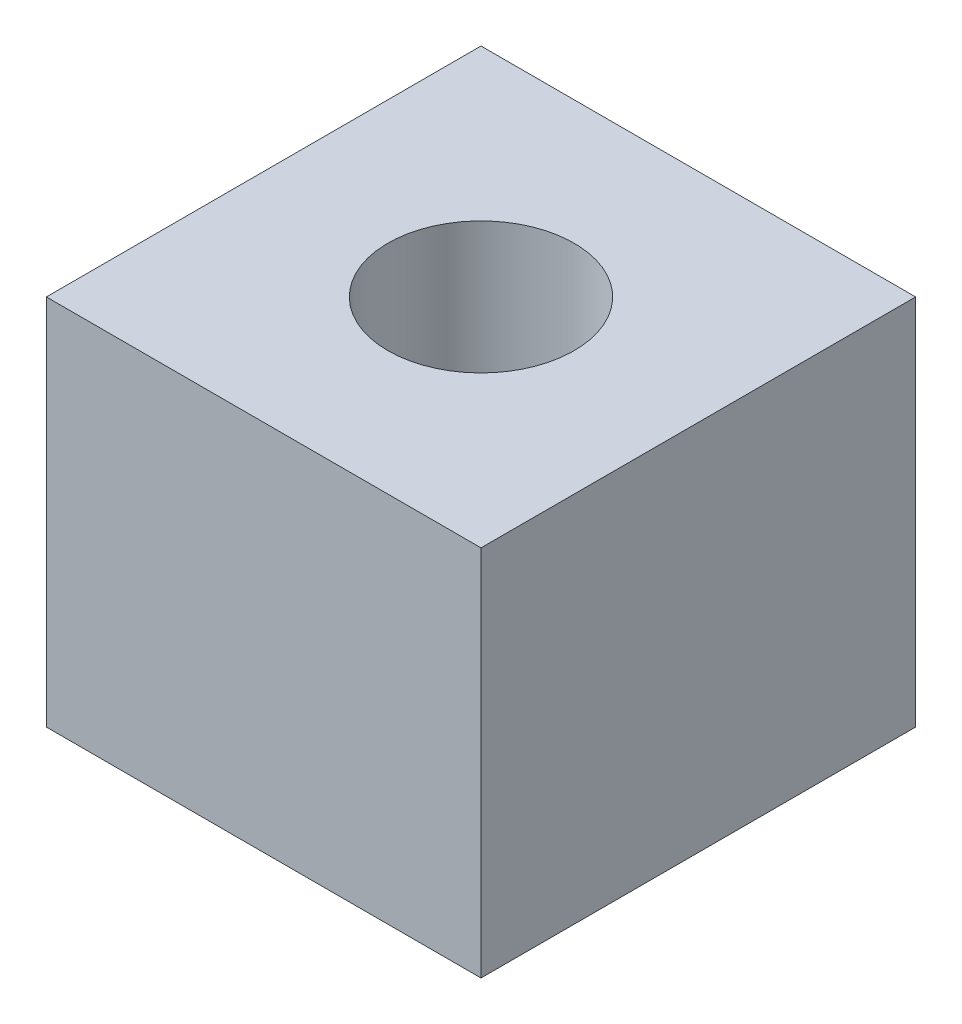
ISO-10303-21;
HEADER;
FILE_DESCRIPTION(('STEP AP214'),'2;1');
FILE_NAME('part.step','',(''),(''),'','','');
FILE_SCHEMA(('AUTOMOTIVE_DESIGN { 1 0 10303 214 1 1 1 1 }'));
ENDSEC;
DATA;
#1=APPLICATION_CONTEXT('core data for automotive mechanical design processes');
#2=APPLICATION_PROTOCOL_DEFINITION('international standard','automotive_design',2000,#1);
#3=PRODUCT_CONTEXT('',#1,'mechanical');
#4=PRODUCT('Part','Part','',(#3));
#5=PRODUCT_RELATED_PRODUCT_CATEGORY('part','',(#4));
#6=PRODUCT_DEFINITION_FORMATION('','',#4);
#7=PRODUCT_DEFINITION_CONTEXT('part definition',#1,'design');
#8=PRODUCT_DEFINITION('design','',#6,#7);
#9=PRODUCT_DEFINITION_SHAPE('','',#8);
#10=(LENGTH_UNIT() NAMED_UNIT(*) SI_UNIT(.MILLI.,.METRE.));
#11=(NAMED_UNIT(*) PLANE_ANGLE_UNIT() SI_UNIT($,.RADIAN.));
#12=(NAMED_UNIT(*) SI_UNIT($,.STERADIAN.) SOLID_ANGLE_UNIT());
#13=UNCERTAINTY_MEASURE_WITH_UNIT(LENGTH_MEASURE(1.E-05),#10,'distance_accuracy_value','');
#14=(GEOMETRIC_REPRESENTATION_CONTEXT(3) GLOBAL_UNCERTAINTY_ASSIGNED_CONTEXT((#13)) GLOBAL_UNIT_ASSIGNED_CONTEXT((#10,
#11,#12)) REPRESENTATION_CONTEXT('',''));
#15=CARTESIAN_POINT('',(0.,0.,0.));
#16=DIRECTION('',(0.,0.,1.));
#17=DIRECTION('',(1.,0.,0.));
#18=AXIS2_PLACEMENT_3D('',#15,#16,#17);
#19=CARTESIAN_POINT('',(17.5,30.,-17.5));
#20=DIRECTION('',(-1.,0.,0.));
#21=DIRECTION('',(0.,0.,1.));
#22=AXIS2_PLACEMENT_3D('',#19,#20,#21);
#23=PLANE('',#22);
#24=DIRECTION('',(0.,0.,-1.));
#25=VECTOR('',#24,1.);
#26=CARTESIAN_POINT('',(17.5,0.,-17.5));
#27=LINE('',#26,#25);
#28=CARTESIAN_POINT('',(17.5,0.,17.5));
#29=VERTEX_POINT('',#28);
#30=CARTESIAN_POINT('',(17.5,0.,-17.5));
#31=VERTEX_POINT('',#30);
#32=EDGE_CURVE('E102',#29,#31,#27,.T.);
#33=ORIENTED_EDGE('',*,*,#32,.T.);
#34=DIRECTION('',(0.,-1.,0.));
#35=VECTOR('',#34,1.);
#36=CARTESIAN_POINT('',(17.5,30.,-17.5));
#37=LINE('',#36,#35);
#38=CARTESIAN_POINT('',(17.5,30.,-17.5));
#39=VERTEX_POINT('',#38);
#40=EDGE_CURVE('E11',#39,#31,#37,.T.);
#41=ORIENTED_EDGE('',*,*,#40,.F.);
#42=DIRECTION('',(0.,0.,-1.));
#43=VECTOR('',#42,1.);
#44=CARTESIAN_POINT('',(17.5,30.,-17.5));
#45=LINE('',#44,#43);
#46=CARTESIAN_POINT('',(17.5,30.,17.5));
#47=VERTEX_POINT('',#46);
#48=EDGE_CURVE('E90',#47,#39,#45,.T.);
#49=ORIENTED_EDGE('',*,*,#48,.F.);
#50=DIRECTION('',(0.,-1.,0.));
#51=VECTOR('',#50,1.);
#52=CARTESIAN_POINT('',(17.5,30.,17.5));
#53=LINE('',#52,#51);
#54=EDGE_CURVE('E98',#47,#29,#53,.T.);
#55=ORIENTED_EDGE('',*,*,#54,.T.);
#56=EDGE_LOOP('',(#33,#41,#49,#55));
#57=FACE_BOUND('',#56,.T.);
#58=ADVANCED_FACE('F39',(#57),#23,.F.);
#59=CARTESIAN_POINT('',(-17.5,30.,-17.5));
#60=DIRECTION('',(0.,0.,1.));
#61=DIRECTION('',(1.,0.,0.));
#62=AXIS2_PLACEMENT_3D('',#59,#60,#61);
#63=PLANE('',#62);
#64=DIRECTION('',(-1.,0.,0.));
#65=VECTOR('',#64,1.);
#66=CARTESIAN_POINT('',(-17.5,0.,-17.5));
#67=LINE('',#66,#65);
#68=CARTESIAN_POINT('',(-17.5,0.,-17.5));
#69=VERTEX_POINT('',#68);
#70=EDGE_CURVE('E94',#31,#69,#67,.T.);
#71=ORIENTED_EDGE('',*,*,#70,.T.);
#72=DIRECTION('',(0.,-1.,0.));
#73=VECTOR('',#72,1.);
#74=CARTESIAN_POINT('',(-17.5,30.,-17.5));
#75=LINE('',#74,#73);
#76=CARTESIAN_POINT('',(-17.5,30.,-17.5));
#77=VERTEX_POINT('',#76);
#78=EDGE_CURVE('E47',#77,#69,#75,.T.);
#79=ORIENTED_EDGE('',*,*,#78,.F.);
#80=DIRECTION('',(-1.,0.,0.));
#81=VECTOR('',#80,1.);
#82=CARTESIAN_POINT('',(-17.5,30.,-17.5));
#83=LINE('',#82,#81);
#84=EDGE_CURVE('E85',#39,#77,#83,.T.);
#85=ORIENTED_EDGE('',*,*,#84,.F.);
#86=ORIENTED_EDGE('',*,*,#40,.T.);
#87=EDGE_LOOP('',(#71,#79,#85,#86));
#88=FACE_BOUND('',#87,.T.);
#89=ADVANCED_FACE('F93',(#88),#63,.F.);
#90=CARTESIAN_POINT('',(-17.5,30.,-17.5));
#91=DIRECTION('',(1.,0.,0.));
#92=DIRECTION('',(0.,0.,-1.));
#93=AXIS2_PLACEMENT_3D('',#90,#91,#92);
#94=PLANE('',#93);
#95=DIRECTION('',(0.,0.,1.));
#96=VECTOR('',#95,1.);
#97=CARTESIAN_POINT('',(-17.5,0.,-17.5));
#98=LINE('',#97,#96);
#99=CARTESIAN_POINT('',(-17.5,0.,17.5));
#100=VERTEX_POINT('',#99);
#101=EDGE_CURVE('E72',#69,#100,#98,.T.);
#102=ORIENTED_EDGE('',*,*,#101,.T.);
#103=DIRECTION('',(0.,-1.,0.));
#104=VECTOR('',#103,1.);
#105=CARTESIAN_POINT('',(-17.5,30.,17.5));
#106=LINE('',#105,#104);
#107=CARTESIAN_POINT('',(-17.5,30.,17.5));
#108=VERTEX_POINT('',#107);
#109=EDGE_CURVE('E95',#108,#100,#106,.T.);
#110=ORIENTED_EDGE('',*,*,#109,.F.);
#111=DIRECTION('',(0.,0.,1.));
#112=VECTOR('',#111,1.);
#113=CARTESIAN_POINT('',(-17.5,30.,-17.5));
#114=LINE('',#113,#112);
#115=EDGE_CURVE('E88',#77,#108,#114,.T.);
#116=ORIENTED_EDGE('',*,*,#115,.F.);
#117=ORIENTED_EDGE('',*,*,#78,.T.);
#118=EDGE_LOOP('',(#102,#110,#116,#117));
#119=FACE_BOUND('',#118,.T.);
#120=ADVANCED_FACE('F96',(#119),#94,.F.);
#121=CARTESIAN_POINT('',(-17.5,30.,17.5));
#122=DIRECTION('',(0.,0.,-1.));
#123=DIRECTION('',(-1.,0.,0.));
#124=AXIS2_PLACEMENT_3D('',#121,#122,#123);
#125=PLANE('',#124);
#126=DIRECTION('',(1.,0.,0.));
#127=VECTOR('',#126,1.);
#128=CARTESIAN_POINT('',(-17.5,0.,17.5));
#129=LINE('',#128,#127);
#130=EDGE_CURVE('E78',#100,#29,#129,.T.);
#131=ORIENTED_EDGE('',*,*,#130,.T.);
#132=ORIENTED_EDGE('',*,*,#54,.F.);
#133=DIRECTION('',(1.,0.,0.));
#134=VECTOR('',#133,1.);
#135=CARTESIAN_POINT('',(-17.5,30.,17.5));
#136=LINE('',#135,#134);
#137=EDGE_CURVE('E55',#108,#47,#136,.T.);
#138=ORIENTED_EDGE('',*,*,#137,.F.);
#139=ORIENTED_EDGE('',*,*,#109,.T.);
#140=EDGE_LOOP('',(#131,#132,#138,#139));
#141=FACE_BOUND('',#140,.T.);
#142=ADVANCED_FACE('F110',(#141),#125,.F.);
#143=CARTESIAN_POINT('',(0.,30.,0.));
#144=DIRECTION('',(0.,1.,0.));
#145=DIRECTION('',(0.,0.,1.));
#146=AXIS2_PLACEMENT_3D('',#143,#144,#145);
#147=PLANE('',#146);
#148=CARTESIAN_POINT('',(0.,30.,0.));
#149=DIRECTION('',(0.,1.,0.));
#150=DIRECTION('',(0.,0.,1.));
#151=AXIS2_PLACEMENT_3D('',#148,#149,#150);
#152=CIRCLE('',#151,7.5);
#153=CARTESIAN_POINT('',(0.,30.,7.5));
#154=VERTEX_POINT('',#153);
#155=EDGE_CURVE('E116',#154,#154,#152,.T.);
#156=ORIENTED_EDGE('',*,*,#155,.F.);
#157=EDGE_LOOP('',(#156));
#158=FACE_BOUND('',#157,.T.);
#159=ORIENTED_EDGE('',*,*,#48,.T.);
#160=ORIENTED_EDGE('',*,*,#84,.T.);
#161=ORIENTED_EDGE('',*,*,#115,.T.);
#162=ORIENTED_EDGE('',*,*,#137,.T.);
#163=EDGE_LOOP('',(#159,#160,#161,#162));
#164=FACE_BOUND('',#163,.T.);
#165=ADVANCED_FACE('F86',(#158,#164),#147,.T.);
#166=CARTESIAN_POINT('',(0.,0.,0.));
#167=DIRECTION('',(0.,1.,0.));
#168=DIRECTION('',(0.,0.,1.));
#169=AXIS2_PLACEMENT_3D('',#166,#167,#168);
#170=PLANE('',#169);
#171=ORIENTED_EDGE('',*,*,#32,.F.);
#172=ORIENTED_EDGE('',*,*,#130,.F.);
#173=ORIENTED_EDGE('',*,*,#101,.F.);
#174=ORIENTED_EDGE('',*,*,#70,.F.);
#175=EDGE_LOOP('',(#171,#172,#173,#174));
#176=FACE_BOUND('',#175,.T.);
#177=ADVANCED_FACE('F113',(#176),#170,.F.);
#178=CARTESIAN_POINT('',(0.,10.,0.));
#179=DIRECTION('',(0.,1.,0.));
#180=DIRECTION('',(0.,0.,1.));
#181=AXIS2_PLACEMENT_3D('',#178,#179,#180);
#182=CYLINDRICAL_SURFACE('',#181,7.5);
#183=CARTESIAN_POINT('',(0.,10.,0.));
#184=DIRECTION('',(0.,1.,0.));
#185=DIRECTION('',(0.,0.,1.));
#186=AXIS2_PLACEMENT_3D('',#183,#184,#185);
#187=CIRCLE('',#186,7.5);
#188=CARTESIAN_POINT('',(0.,10.,7.5));
#189=VERTEX_POINT('',#188);
#190=EDGE_CURVE('E105',#189,#189,#187,.T.);
#191=ORIENTED_EDGE('',*,*,#190,.F.);
#192=EDGE_LOOP('',(#191));
#193=FACE_BOUND('',#192,.T.);
#194=ORIENTED_EDGE('',*,*,#155,.T.);
#195=EDGE_LOOP('',(#194));
#196=FACE_BOUND('',#195,.T.);
#197=ADVANCED_FACE('F124',(#193,#196),#182,.F.);
#198=CARTESIAN_POINT('',(0.,10.,0.));
#199=DIRECTION('',(0.,1.,0.));
#200=DIRECTION('',(0.,0.,1.));
#201=AXIS2_PLACEMENT_3D('',#198,#199,#200);
#202=PLANE('',#201);
#203=ORIENTED_EDGE('',*,*,#190,.T.);
#204=EDGE_LOOP('',(#203));
#205=FACE_BOUND('',#204,.T.);
#206=ADVANCED_FACE('F122',(#205),#202,.T.);
#207=CLOSED_SHELL('',(#58,#89,#120,#142,#165,#177,#197,#206));
#208=MANIFOLD_SOLID_BREP('B2',#207);
#209=ADVANCED_BREP_SHAPE_REPRESENTATION('',(#18,#208),#14);
#210=SHAPE_DEFINITION_REPRESENTATION(#9,#209);
ENDSEC;
END-ISO-10303-21;
